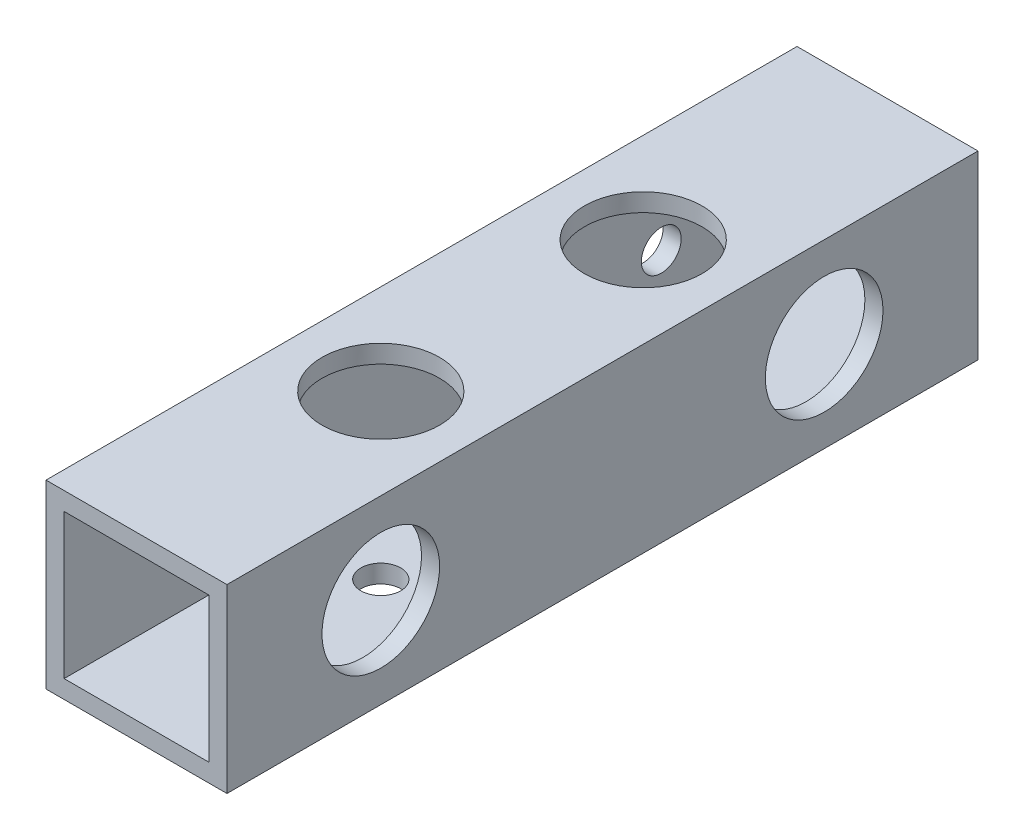
ISO-10303-21;
HEADER;
FILE_DESCRIPTION(('STEP AP214'),'2;1');
FILE_NAME('part.step','',(''),(''),'','','');
FILE_SCHEMA(('AUTOMOTIVE_DESIGN { 1 0 10303 214 1 1 1 1 }'));
ENDSEC;
DATA;
#1=APPLICATION_CONTEXT('core data for automotive mechanical design processes');
#2=APPLICATION_PROTOCOL_DEFINITION('international standard','automotive_design',2000,#1);
#3=PRODUCT_CONTEXT('',#1,'mechanical');
#4=PRODUCT('Part','Part','',(#3));
#5=PRODUCT_RELATED_PRODUCT_CATEGORY('part','',(#4));
#6=PRODUCT_DEFINITION_FORMATION('','',#4);
#7=PRODUCT_DEFINITION_CONTEXT('part definition',#1,'design');
#8=PRODUCT_DEFINITION('design','',#6,#7);
#9=PRODUCT_DEFINITION_SHAPE('','',#8);
#10=(LENGTH_UNIT() NAMED_UNIT(*) SI_UNIT(.MILLI.,.METRE.));
#11=(NAMED_UNIT(*) PLANE_ANGLE_UNIT() SI_UNIT($,.RADIAN.));
#12=(NAMED_UNIT(*) SI_UNIT($,.STERADIAN.) SOLID_ANGLE_UNIT());
#13=UNCERTAINTY_MEASURE_WITH_UNIT(LENGTH_MEASURE(1.E-05),#10,'distance_accuracy_value','');
#14=(GEOMETRIC_REPRESENTATION_CONTEXT(3) GLOBAL_UNCERTAINTY_ASSIGNED_CONTEXT((#13)) GLOBAL_UNIT_ASSIGNED_CONTEXT((#10,
#11,#12)) REPRESENTATION_CONTEXT('',''));
#15=CARTESIAN_POINT('',(0.,0.,0.));
#16=DIRECTION('',(0.,0.,1.));
#17=DIRECTION('',(1.,0.,0.));
#18=AXIS2_PLACEMENT_3D('',#15,#16,#17);
#19=CARTESIAN_POINT('',(0.,0.,83.));
#20=DIRECTION('',(0.,0.,1.));
#21=DIRECTION('',(1.,0.,0.));
#22=AXIS2_PLACEMENT_3D('',#19,#20,#21);
#23=PLANE('',#22);
#24=DIRECTION('',(0.,1.,0.));
#25=VECTOR('',#24,1.);
#26=CARTESIAN_POINT('',(10.,10.,83.));
#27=LINE('',#26,#25);
#28=CARTESIAN_POINT('',(10.,-10.,83.));
#29=VERTEX_POINT('',#28);
#30=CARTESIAN_POINT('',(10.,10.,83.));
#31=VERTEX_POINT('',#30);
#32=EDGE_CURVE('E156',#29,#31,#27,.T.);
#33=ORIENTED_EDGE('',*,*,#32,.T.);
#34=DIRECTION('',(-1.,0.,0.));
#35=VECTOR('',#34,1.);
#36=CARTESIAN_POINT('',(-10.,10.,83.));
#37=LINE('',#36,#35);
#38=CARTESIAN_POINT('',(-10.,10.,83.));
#39=VERTEX_POINT('',#38);
#40=EDGE_CURVE('E160',#31,#39,#37,.T.);
#41=ORIENTED_EDGE('',*,*,#40,.T.);
#42=DIRECTION('',(0.,-1.,0.));
#43=VECTOR('',#42,1.);
#44=CARTESIAN_POINT('',(-10.,10.,83.));
#45=LINE('',#44,#43);
#46=CARTESIAN_POINT('',(-10.,-10.,83.));
#47=VERTEX_POINT('',#46);
#48=EDGE_CURVE('E164',#39,#47,#45,.T.);
#49=ORIENTED_EDGE('',*,*,#48,.T.);
#50=DIRECTION('',(1.,0.,0.));
#51=VECTOR('',#50,1.);
#52=CARTESIAN_POINT('',(-10.,-10.,83.));
#53=LINE('',#52,#51);
#54=EDGE_CURVE('E167',#47,#29,#53,.T.);
#55=ORIENTED_EDGE('',*,*,#54,.T.);
#56=EDGE_LOOP('',(#33,#41,#49,#55));
#57=FACE_BOUND('',#56,.T.);
#58=DIRECTION('',(-1.,0.,0.));
#59=VECTOR('',#58,1.);
#60=CARTESIAN_POINT('',(-8.,8.,83.));
#61=LINE('',#60,#59);
#62=CARTESIAN_POINT('',(8.,8.,83.));
#63=VERTEX_POINT('',#62);
#64=CARTESIAN_POINT('',(-8.,8.,83.));
#65=VERTEX_POINT('',#64);
#66=EDGE_CURVE('E115',#63,#65,#61,.T.);
#67=ORIENTED_EDGE('',*,*,#66,.F.);
#68=DIRECTION('',(0.,1.,0.));
#69=VECTOR('',#68,1.);
#70=CARTESIAN_POINT('',(8.,8.,83.));
#71=LINE('',#70,#69);
#72=CARTESIAN_POINT('',(8.,-8.,83.));
#73=VERTEX_POINT('',#72);
#74=EDGE_CURVE('E106',#73,#63,#71,.T.);
#75=ORIENTED_EDGE('',*,*,#74,.F.);
#76=DIRECTION('',(1.,0.,0.));
#77=VECTOR('',#76,1.);
#78=CARTESIAN_POINT('',(-8.,-8.,83.));
#79=LINE('',#78,#77);
#80=CARTESIAN_POINT('',(-8.,-8.,83.));
#81=VERTEX_POINT('',#80);
#82=EDGE_CURVE('E132',#81,#73,#79,.T.);
#83=ORIENTED_EDGE('',*,*,#82,.F.);
#84=DIRECTION('',(0.,-1.,0.));
#85=VECTOR('',#84,1.);
#86=CARTESIAN_POINT('',(-8.,8.,83.));
#87=LINE('',#86,#85);
#88=EDGE_CURVE('E128',#65,#81,#87,.T.);
#89=ORIENTED_EDGE('',*,*,#88,.F.);
#90=EDGE_LOOP('',(#67,#75,#83,#89));
#91=FACE_BOUND('',#90,.T.);
#92=ADVANCED_FACE('F38',(#57,#91),#23,.T.);
#93=CARTESIAN_POINT('',(0.,0.,0.));
#94=DIRECTION('',(0.,0.,1.));
#95=DIRECTION('',(1.,0.,0.));
#96=AXIS2_PLACEMENT_3D('',#93,#94,#95);
#97=PLANE('',#96);
#98=DIRECTION('',(0.,1.,0.));
#99=VECTOR('',#98,1.);
#100=CARTESIAN_POINT('',(10.,10.,0.));
#101=LINE('',#100,#99);
#102=CARTESIAN_POINT('',(10.,-10.,0.));
#103=VERTEX_POINT('',#102);
#104=CARTESIAN_POINT('',(10.,10.,0.));
#105=VERTEX_POINT('',#104);
#106=EDGE_CURVE('E124',#103,#105,#101,.T.);
#107=ORIENTED_EDGE('',*,*,#106,.F.);
#108=DIRECTION('',(1.,0.,0.));
#109=VECTOR('',#108,1.);
#110=CARTESIAN_POINT('',(-10.,-10.,0.));
#111=LINE('',#110,#109);
#112=CARTESIAN_POINT('',(-10.,-10.,0.));
#113=VERTEX_POINT('',#112);
#114=EDGE_CURVE('E161',#113,#103,#111,.T.);
#115=ORIENTED_EDGE('',*,*,#114,.F.);
#116=DIRECTION('',(0.,-1.,0.));
#117=VECTOR('',#116,1.);
#118=CARTESIAN_POINT('',(-10.,10.,0.));
#119=LINE('',#118,#117);
#120=CARTESIAN_POINT('',(-10.,10.,0.));
#121=VERTEX_POINT('',#120);
#122=EDGE_CURVE('E177',#121,#113,#119,.T.);
#123=ORIENTED_EDGE('',*,*,#122,.F.);
#124=DIRECTION('',(-1.,0.,0.));
#125=VECTOR('',#124,1.);
#126=CARTESIAN_POINT('',(-10.,10.,0.));
#127=LINE('',#126,#125);
#128=EDGE_CURVE('E174',#105,#121,#127,.T.);
#129=ORIENTED_EDGE('',*,*,#128,.F.);
#130=EDGE_LOOP('',(#107,#115,#123,#129));
#131=FACE_BOUND('',#130,.T.);
#132=DIRECTION('',(0.,1.,0.));
#133=VECTOR('',#132,1.);
#134=CARTESIAN_POINT('',(8.,8.,0.));
#135=LINE('',#134,#133);
#136=CARTESIAN_POINT('',(8.,-8.,0.));
#137=VERTEX_POINT('',#136);
#138=CARTESIAN_POINT('',(8.,8.,0.));
#139=VERTEX_POINT('',#138);
#140=EDGE_CURVE('E64',#137,#139,#135,.T.);
#141=ORIENTED_EDGE('',*,*,#140,.T.);
#142=DIRECTION('',(-1.,0.,0.));
#143=VECTOR('',#142,1.);
#144=CARTESIAN_POINT('',(-8.,8.,0.));
#145=LINE('',#144,#143);
#146=CARTESIAN_POINT('',(-8.,8.,0.));
#147=VERTEX_POINT('',#146);
#148=EDGE_CURVE('E122',#139,#147,#145,.T.);
#149=ORIENTED_EDGE('',*,*,#148,.T.);
#150=DIRECTION('',(0.,-1.,0.));
#151=VECTOR('',#150,1.);
#152=CARTESIAN_POINT('',(-8.,8.,0.));
#153=LINE('',#152,#151);
#154=CARTESIAN_POINT('',(-8.,-8.,0.));
#155=VERTEX_POINT('',#154);
#156=EDGE_CURVE('E143',#147,#155,#153,.T.);
#157=ORIENTED_EDGE('',*,*,#156,.T.);
#158=DIRECTION('',(1.,0.,0.));
#159=VECTOR('',#158,1.);
#160=CARTESIAN_POINT('',(-8.,-8.,0.));
#161=LINE('',#160,#159);
#162=EDGE_CURVE('E116',#155,#137,#161,.T.);
#163=ORIENTED_EDGE('',*,*,#162,.T.);
#164=EDGE_LOOP('',(#141,#149,#157,#163));
#165=FACE_BOUND('',#164,.T.);
#166=ADVANCED_FACE('F276',(#131,#165),#97,.F.);
#167=CARTESIAN_POINT('',(10.,10.,83.));
#168=DIRECTION('',(-1.,0.,0.));
#169=DIRECTION('',(0.,0.,1.));
#170=AXIS2_PLACEMENT_3D('',#167,#168,#169);
#171=PLANE('',#170);
#172=CARTESIAN_POINT('',(10.,0.,66.));
#173=DIRECTION('',(1.,0.,0.));
#174=DIRECTION('',(0.,0.,-1.));
#175=AXIS2_PLACEMENT_3D('',#172,#173,#174);
#176=CIRCLE('',#175,6.5);
#177=CARTESIAN_POINT('',(10.,0.,59.5));
#178=VERTEX_POINT('',#177);
#179=EDGE_CURVE('E206',#178,#178,#176,.T.);
#180=ORIENTED_EDGE('',*,*,#179,.F.);
#181=EDGE_LOOP('',(#180));
#182=FACE_BOUND('',#181,.T.);
#183=CARTESIAN_POINT('',(10.,0.,17.));
#184=DIRECTION('',(1.,0.,0.));
#185=DIRECTION('',(0.,0.,-1.));
#186=AXIS2_PLACEMENT_3D('',#183,#184,#185);
#187=CIRCLE('',#186,6.5);
#188=CARTESIAN_POINT('',(10.,0.,10.5));
#189=VERTEX_POINT('',#188);
#190=EDGE_CURVE('E243',#189,#189,#187,.T.);
#191=ORIENTED_EDGE('',*,*,#190,.F.);
#192=EDGE_LOOP('',(#191));
#193=FACE_BOUND('',#192,.T.);
#194=ORIENTED_EDGE('',*,*,#106,.T.);
#195=DIRECTION('',(0.,0.,-1.));
#196=VECTOR('',#195,1.);
#197=CARTESIAN_POINT('',(10.,10.,83.));
#198=LINE('',#197,#196);
#199=EDGE_CURVE('E11',#31,#105,#198,.T.);
#200=ORIENTED_EDGE('',*,*,#199,.F.);
#201=ORIENTED_EDGE('',*,*,#32,.F.);
#202=DIRECTION('',(0.,0.,-1.));
#203=VECTOR('',#202,1.);
#204=CARTESIAN_POINT('',(10.,-10.,83.));
#205=LINE('',#204,#203);
#206=EDGE_CURVE('E170',#29,#103,#205,.T.);
#207=ORIENTED_EDGE('',*,*,#206,.T.);
#208=EDGE_LOOP('',(#194,#200,#201,#207));
#209=FACE_BOUND('',#208,.T.);
#210=ADVANCED_FACE('F40',(#182,#193,#209),#171,.F.);
#211=CARTESIAN_POINT('',(-10.,10.,83.));
#212=DIRECTION('',(0.,-1.,0.));
#213=DIRECTION('',(0.,0.,-1.));
#214=AXIS2_PLACEMENT_3D('',#211,#212,#213);
#215=PLANE('',#214);
#216=CARTESIAN_POINT('',(0.,10.,56.));
#217=DIRECTION('',(0.,1.,0.));
#218=DIRECTION('',(0.,0.,1.));
#219=AXIS2_PLACEMENT_3D('',#216,#217,#218);
#220=CIRCLE('',#219,6.5);
#221=CARTESIAN_POINT('',(0.,10.,62.5));
#222=VERTEX_POINT('',#221);
#223=EDGE_CURVE('E222',#222,#222,#220,.T.);
#224=ORIENTED_EDGE('',*,*,#223,.F.);
#225=EDGE_LOOP('',(#224));
#226=FACE_BOUND('',#225,.T.);
#227=CARTESIAN_POINT('',(0.,10.,27.));
#228=DIRECTION('',(0.,1.,0.));
#229=DIRECTION('',(0.,0.,1.));
#230=AXIS2_PLACEMENT_3D('',#227,#228,#229);
#231=CIRCLE('',#230,6.5);
#232=CARTESIAN_POINT('',(0.,10.,33.5));
#233=VERTEX_POINT('',#232);
#234=EDGE_CURVE('E229',#233,#233,#231,.T.);
#235=ORIENTED_EDGE('',*,*,#234,.F.);
#236=EDGE_LOOP('',(#235));
#237=FACE_BOUND('',#236,.T.);
#238=ORIENTED_EDGE('',*,*,#128,.T.);
#239=DIRECTION('',(0.,0.,-1.));
#240=VECTOR('',#239,1.);
#241=CARTESIAN_POINT('',(-10.,10.,83.));
#242=LINE('',#241,#240);
#243=EDGE_CURVE('E48',#39,#121,#242,.T.);
#244=ORIENTED_EDGE('',*,*,#243,.F.);
#245=ORIENTED_EDGE('',*,*,#40,.F.);
#246=ORIENTED_EDGE('',*,*,#199,.T.);
#247=EDGE_LOOP('',(#238,#244,#245,#246));
#248=FACE_BOUND('',#247,.T.);
#249=ADVANCED_FACE('F292',(#226,#237,#248),#215,.F.);
#250=CARTESIAN_POINT('',(-10.,10.,83.));
#251=DIRECTION('',(1.,0.,0.));
#252=DIRECTION('',(0.,0.,-1.));
#253=AXIS2_PLACEMENT_3D('',#250,#251,#252);
#254=PLANE('',#253);
#255=CARTESIAN_POINT('',(-10.,0.,66.));
#256=DIRECTION('',(1.,0.,0.));
#257=DIRECTION('',(0.,0.,-1.));
#258=AXIS2_PLACEMENT_3D('',#255,#256,#257);
#259=CIRCLE('',#258,2.2);
#260=CARTESIAN_POINT('',(-10.,0.,63.8));
#261=VERTEX_POINT('',#260);
#262=EDGE_CURVE('E140',#261,#261,#259,.T.);
#263=ORIENTED_EDGE('',*,*,#262,.T.);
#264=EDGE_LOOP('',(#263));
#265=FACE_BOUND('',#264,.T.);
#266=CARTESIAN_POINT('',(-10.,0.,17.));
#267=DIRECTION('',(1.,0.,0.));
#268=DIRECTION('',(0.,0.,-1.));
#269=AXIS2_PLACEMENT_3D('',#266,#267,#268);
#270=CIRCLE('',#269,2.2);
#271=CARTESIAN_POINT('',(-10.,0.,14.8));
#272=VERTEX_POINT('',#271);
#273=EDGE_CURVE('E196',#272,#272,#270,.T.);
#274=ORIENTED_EDGE('',*,*,#273,.T.);
#275=EDGE_LOOP('',(#274));
#276=FACE_BOUND('',#275,.T.);
#277=ORIENTED_EDGE('',*,*,#122,.T.);
#278=DIRECTION('',(0.,0.,-1.));
#279=VECTOR('',#278,1.);
#280=CARTESIAN_POINT('',(-10.,-10.,83.));
#281=LINE('',#280,#279);
#282=EDGE_CURVE('E185',#47,#113,#281,.T.);
#283=ORIENTED_EDGE('',*,*,#282,.F.);
#284=ORIENTED_EDGE('',*,*,#48,.F.);
#285=ORIENTED_EDGE('',*,*,#243,.T.);
#286=EDGE_LOOP('',(#277,#283,#284,#285));
#287=FACE_BOUND('',#286,.T.);
#288=ADVANCED_FACE('F256',(#265,#276,#287),#254,.F.);
#289=CARTESIAN_POINT('',(-10.,-10.,83.));
#290=DIRECTION('',(0.,1.,0.));
#291=DIRECTION('',(0.,0.,1.));
#292=AXIS2_PLACEMENT_3D('',#289,#290,#291);
#293=PLANE('',#292);
#294=CARTESIAN_POINT('',(0.,-10.,56.));
#295=DIRECTION('',(0.,1.,0.));
#296=DIRECTION('',(0.,0.,1.));
#297=AXIS2_PLACEMENT_3D('',#294,#295,#296);
#298=CIRCLE('',#297,2.2);
#299=CARTESIAN_POINT('',(0.,-10.,58.2));
#300=VERTEX_POINT('',#299);
#301=EDGE_CURVE('E218',#300,#300,#298,.T.);
#302=ORIENTED_EDGE('',*,*,#301,.T.);
#303=EDGE_LOOP('',(#302));
#304=FACE_BOUND('',#303,.T.);
#305=CARTESIAN_POINT('',(0.,-10.,27.));
#306=DIRECTION('',(0.,1.,0.));
#307=DIRECTION('',(0.,0.,1.));
#308=AXIS2_PLACEMENT_3D('',#305,#306,#307);
#309=CIRCLE('',#308,2.2);
#310=CARTESIAN_POINT('',(0.,-10.,29.2));
#311=VERTEX_POINT('',#310);
#312=EDGE_CURVE('E214',#311,#311,#309,.T.);
#313=ORIENTED_EDGE('',*,*,#312,.T.);
#314=EDGE_LOOP('',(#313));
#315=FACE_BOUND('',#314,.T.);
#316=ORIENTED_EDGE('',*,*,#114,.T.);
#317=ORIENTED_EDGE('',*,*,#206,.F.);
#318=ORIENTED_EDGE('',*,*,#54,.F.);
#319=ORIENTED_EDGE('',*,*,#282,.T.);
#320=EDGE_LOOP('',(#316,#317,#318,#319));
#321=FACE_BOUND('',#320,.T.);
#322=ADVANCED_FACE('F287',(#304,#315,#321),#293,.F.);
#323=CARTESIAN_POINT('',(8.,8.,83.));
#324=DIRECTION('',(-1.,0.,0.));
#325=DIRECTION('',(0.,0.,1.));
#326=AXIS2_PLACEMENT_3D('',#323,#324,#325);
#327=PLANE('',#326);
#328=CARTESIAN_POINT('',(8.,0.,66.));
#329=DIRECTION('',(-1.,0.,0.));
#330=DIRECTION('',(0.,0.,1.));
#331=AXIS2_PLACEMENT_3D('',#328,#329,#330);
#332=CIRCLE('',#331,6.5);
#333=CARTESIAN_POINT('',(8.,0.,72.5));
#334=VERTEX_POINT('',#333);
#335=EDGE_CURVE('E197',#334,#334,#332,.T.);
#336=ORIENTED_EDGE('',*,*,#335,.F.);
#337=EDGE_LOOP('',(#336));
#338=FACE_BOUND('',#337,.T.);
#339=CARTESIAN_POINT('',(8.,0.,17.));
#340=DIRECTION('',(-1.,0.,0.));
#341=DIRECTION('',(0.,0.,1.));
#342=AXIS2_PLACEMENT_3D('',#339,#340,#341);
#343=CIRCLE('',#342,6.5);
#344=CARTESIAN_POINT('',(8.,0.,23.5));
#345=VERTEX_POINT('',#344);
#346=EDGE_CURVE('E202',#345,#345,#343,.T.);
#347=ORIENTED_EDGE('',*,*,#346,.F.);
#348=EDGE_LOOP('',(#347));
#349=FACE_BOUND('',#348,.T.);
#350=ORIENTED_EDGE('',*,*,#140,.F.);
#351=DIRECTION('',(0.,0.,-1.));
#352=VECTOR('',#351,1.);
#353=CARTESIAN_POINT('',(8.,-8.,83.));
#354=LINE('',#353,#352);
#355=EDGE_CURVE('E110',#73,#137,#354,.T.);
#356=ORIENTED_EDGE('',*,*,#355,.F.);
#357=ORIENTED_EDGE('',*,*,#74,.T.);
#358=DIRECTION('',(0.,0.,-1.));
#359=VECTOR('',#358,1.);
#360=CARTESIAN_POINT('',(8.,8.,83.));
#361=LINE('',#360,#359);
#362=EDGE_CURVE('E109',#63,#139,#361,.T.);
#363=ORIENTED_EDGE('',*,*,#362,.T.);
#364=EDGE_LOOP('',(#350,#356,#357,#363));
#365=FACE_BOUND('',#364,.T.);
#366=ADVANCED_FACE('F108',(#338,#349,#365),#327,.T.);
#367=CARTESIAN_POINT('',(-8.,8.,83.));
#368=DIRECTION('',(0.,-1.,0.));
#369=DIRECTION('',(0.,0.,-1.));
#370=AXIS2_PLACEMENT_3D('',#367,#368,#369);
#371=PLANE('',#370);
#372=CARTESIAN_POINT('',(0.,8.,56.));
#373=DIRECTION('',(0.,-1.,0.));
#374=DIRECTION('',(0.,0.,-1.));
#375=AXIS2_PLACEMENT_3D('',#372,#373,#374);
#376=CIRCLE('',#375,6.5);
#377=CARTESIAN_POINT('',(0.,8.,49.5));
#378=VERTEX_POINT('',#377);
#379=EDGE_CURVE('E42',#378,#378,#376,.T.);
#380=ORIENTED_EDGE('',*,*,#379,.F.);
#381=EDGE_LOOP('',(#380));
#382=FACE_BOUND('',#381,.T.);
#383=CARTESIAN_POINT('',(0.,8.,27.));
#384=DIRECTION('',(0.,-1.,0.));
#385=DIRECTION('',(0.,0.,-1.));
#386=AXIS2_PLACEMENT_3D('',#383,#384,#385);
#387=CIRCLE('',#386,6.5);
#388=CARTESIAN_POINT('',(0.,8.,20.5));
#389=VERTEX_POINT('',#388);
#390=EDGE_CURVE('E219',#389,#389,#387,.T.);
#391=ORIENTED_EDGE('',*,*,#390,.F.);
#392=EDGE_LOOP('',(#391));
#393=FACE_BOUND('',#392,.T.);
#394=ORIENTED_EDGE('',*,*,#148,.F.);
#395=ORIENTED_EDGE('',*,*,#362,.F.);
#396=ORIENTED_EDGE('',*,*,#66,.T.);
#397=DIRECTION('',(0.,0.,-1.));
#398=VECTOR('',#397,1.);
#399=CARTESIAN_POINT('',(-8.,8.,83.));
#400=LINE('',#399,#398);
#401=EDGE_CURVE('E125',#65,#147,#400,.T.);
#402=ORIENTED_EDGE('',*,*,#401,.T.);
#403=EDGE_LOOP('',(#394,#395,#396,#402));
#404=FACE_BOUND('',#403,.T.);
#405=ADVANCED_FACE('F119',(#382,#393,#404),#371,.T.);
#406=CARTESIAN_POINT('',(-8.,8.,83.));
#407=DIRECTION('',(1.,0.,0.));
#408=DIRECTION('',(0.,0.,-1.));
#409=AXIS2_PLACEMENT_3D('',#406,#407,#408);
#410=PLANE('',#409);
#411=CARTESIAN_POINT('',(-8.00000000000001,0.,66.));
#412=DIRECTION('',(1.,0.,0.));
#413=DIRECTION('',(0.,0.,-1.));
#414=AXIS2_PLACEMENT_3D('',#411,#412,#413);
#415=CIRCLE('',#414,2.2);
#416=CARTESIAN_POINT('',(-8.00000000000001,0.,63.8));
#417=VERTEX_POINT('',#416);
#418=EDGE_CURVE('E198',#417,#417,#415,.T.);
#419=ORIENTED_EDGE('',*,*,#418,.F.);
#420=EDGE_LOOP('',(#419));
#421=FACE_BOUND('',#420,.T.);
#422=CARTESIAN_POINT('',(-8.00000000000001,0.,17.));
#423=DIRECTION('',(1.,0.,0.));
#424=DIRECTION('',(0.,0.,-1.));
#425=AXIS2_PLACEMENT_3D('',#422,#423,#424);
#426=CIRCLE('',#425,2.2);
#427=CARTESIAN_POINT('',(-8.00000000000001,0.,14.8));
#428=VERTEX_POINT('',#427);
#429=EDGE_CURVE('E192',#428,#428,#426,.T.);
#430=ORIENTED_EDGE('',*,*,#429,.F.);
#431=EDGE_LOOP('',(#430));
#432=FACE_BOUND('',#431,.T.);
#433=ORIENTED_EDGE('',*,*,#156,.F.);
#434=ORIENTED_EDGE('',*,*,#401,.F.);
#435=ORIENTED_EDGE('',*,*,#88,.T.);
#436=DIRECTION('',(0.,0.,-1.));
#437=VECTOR('',#436,1.);
#438=CARTESIAN_POINT('',(-8.,-8.,83.));
#439=LINE('',#438,#437);
#440=EDGE_CURVE('E56',#81,#155,#439,.T.);
#441=ORIENTED_EDGE('',*,*,#440,.T.);
#442=EDGE_LOOP('',(#433,#434,#435,#441));
#443=FACE_BOUND('',#442,.T.);
#444=ADVANCED_FACE('F320',(#421,#432,#443),#410,.T.);
#445=CARTESIAN_POINT('',(-8.,-8.,83.));
#446=DIRECTION('',(0.,1.,0.));
#447=DIRECTION('',(0.,0.,1.));
#448=AXIS2_PLACEMENT_3D('',#445,#446,#447);
#449=PLANE('',#448);
#450=CARTESIAN_POINT('',(0.,-8.,56.));
#451=DIRECTION('',(0.,1.,0.));
#452=DIRECTION('',(0.,0.,1.));
#453=AXIS2_PLACEMENT_3D('',#450,#451,#452);
#454=CIRCLE('',#453,2.2);
#455=CARTESIAN_POINT('',(0.,-8.,58.2));
#456=VERTEX_POINT('',#455);
#457=EDGE_CURVE('E215',#456,#456,#454,.T.);
#458=ORIENTED_EDGE('',*,*,#457,.F.);
#459=EDGE_LOOP('',(#458));
#460=FACE_BOUND('',#459,.T.);
#461=CARTESIAN_POINT('',(0.,-8.,27.));
#462=DIRECTION('',(0.,1.,0.));
#463=DIRECTION('',(0.,0.,1.));
#464=AXIS2_PLACEMENT_3D('',#461,#462,#463);
#465=CIRCLE('',#464,2.2);
#466=CARTESIAN_POINT('',(0.,-8.,29.2));
#467=VERTEX_POINT('',#466);
#468=EDGE_CURVE('E210',#467,#467,#465,.T.);
#469=ORIENTED_EDGE('',*,*,#468,.F.);
#470=EDGE_LOOP('',(#469));
#471=FACE_BOUND('',#470,.T.);
#472=ORIENTED_EDGE('',*,*,#162,.F.);
#473=ORIENTED_EDGE('',*,*,#440,.F.);
#474=ORIENTED_EDGE('',*,*,#82,.T.);
#475=ORIENTED_EDGE('',*,*,#355,.T.);
#476=EDGE_LOOP('',(#472,#473,#474,#475));
#477=FACE_BOUND('',#476,.T.);
#478=ADVANCED_FACE('F272',(#460,#471,#477),#449,.T.);
#479=CARTESIAN_POINT('',(-73.,0.,17.));
#480=DIRECTION('',(1.,0.,0.));
#481=DIRECTION('',(0.,0.,-1.));
#482=AXIS2_PLACEMENT_3D('',#479,#480,#481);
#483=CYLINDRICAL_SURFACE('',#482,2.2);
#484=ORIENTED_EDGE('',*,*,#429,.T.);
#485=EDGE_LOOP('',(#484));
#486=FACE_BOUND('',#485,.T.);
#487=ORIENTED_EDGE('',*,*,#273,.F.);
#488=EDGE_LOOP('',(#487));
#489=FACE_BOUND('',#488,.T.);
#490=ADVANCED_FACE('F262',(#486,#489),#483,.F.);
#491=CARTESIAN_POINT('',(-73.,0.,66.));
#492=DIRECTION('',(1.,0.,0.));
#493=DIRECTION('',(0.,0.,-1.));
#494=AXIS2_PLACEMENT_3D('',#491,#492,#493);
#495=CYLINDRICAL_SURFACE('',#494,2.2);
#496=ORIENTED_EDGE('',*,*,#418,.T.);
#497=EDGE_LOOP('',(#496));
#498=FACE_BOUND('',#497,.T.);
#499=ORIENTED_EDGE('',*,*,#262,.F.);
#500=EDGE_LOOP('',(#499));
#501=FACE_BOUND('',#500,.T.);
#502=ADVANCED_FACE('F259',(#498,#501),#495,.F.);
#503=CARTESIAN_POINT('',(7.,0.,17.));
#504=DIRECTION('',(1.,0.,0.));
#505=DIRECTION('',(0.,0.,-1.));
#506=AXIS2_PLACEMENT_3D('',#503,#504,#505);
#507=CYLINDRICAL_SURFACE('',#506,6.5);
#508=ORIENTED_EDGE('',*,*,#346,.T.);
#509=EDGE_LOOP('',(#508));
#510=FACE_BOUND('',#509,.T.);
#511=ORIENTED_EDGE('',*,*,#190,.T.);
#512=EDGE_LOOP('',(#511));
#513=FACE_BOUND('',#512,.T.);
#514=ADVANCED_FACE('F261',(#510,#513),#507,.F.);
#515=CARTESIAN_POINT('',(7.,0.,66.));
#516=DIRECTION('',(1.,0.,0.));
#517=DIRECTION('',(0.,0.,-1.));
#518=AXIS2_PLACEMENT_3D('',#515,#516,#517);
#519=CYLINDRICAL_SURFACE('',#518,6.5);
#520=ORIENTED_EDGE('',*,*,#335,.T.);
#521=EDGE_LOOP('',(#520));
#522=FACE_BOUND('',#521,.T.);
#523=ORIENTED_EDGE('',*,*,#179,.T.);
#524=EDGE_LOOP('',(#523));
#525=FACE_BOUND('',#524,.T.);
#526=ADVANCED_FACE('F269',(#522,#525),#519,.F.);
#527=CARTESIAN_POINT('',(0.,10.,27.));
#528=DIRECTION('',(0.,-1.,0.));
#529=DIRECTION('',(0.,0.,-1.));
#530=AXIS2_PLACEMENT_3D('',#527,#528,#529);
#531=CYLINDRICAL_SURFACE('',#530,2.2);
#532=ORIENTED_EDGE('',*,*,#468,.T.);
#533=EDGE_LOOP('',(#532));
#534=FACE_BOUND('',#533,.T.);
#535=ORIENTED_EDGE('',*,*,#312,.F.);
#536=EDGE_LOOP('',(#535));
#537=FACE_BOUND('',#536,.T.);
#538=ADVANCED_FACE('F351',(#534,#537),#531,.F.);
#539=CARTESIAN_POINT('',(0.,10.,56.));
#540=DIRECTION('',(0.,-1.,0.));
#541=DIRECTION('',(0.,0.,-1.));
#542=AXIS2_PLACEMENT_3D('',#539,#540,#541);
#543=CYLINDRICAL_SURFACE('',#542,2.2);
#544=ORIENTED_EDGE('',*,*,#457,.T.);
#545=EDGE_LOOP('',(#544));
#546=FACE_BOUND('',#545,.T.);
#547=ORIENTED_EDGE('',*,*,#301,.F.);
#548=EDGE_LOOP('',(#547));
#549=FACE_BOUND('',#548,.T.);
#550=ADVANCED_FACE('F346',(#546,#549),#543,.F.);
#551=CARTESIAN_POINT('',(0.,7.,27.));
#552=DIRECTION('',(0.,1.,0.));
#553=DIRECTION('',(0.,0.,1.));
#554=AXIS2_PLACEMENT_3D('',#551,#552,#553);
#555=CYLINDRICAL_SURFACE('',#554,6.5);
#556=ORIENTED_EDGE('',*,*,#390,.T.);
#557=EDGE_LOOP('',(#556));
#558=FACE_BOUND('',#557,.T.);
#559=ORIENTED_EDGE('',*,*,#234,.T.);
#560=EDGE_LOOP('',(#559));
#561=FACE_BOUND('',#560,.T.);
#562=ADVANCED_FACE('F341',(#558,#561),#555,.F.);
#563=CARTESIAN_POINT('',(0.,7.,56.));
#564=DIRECTION('',(0.,1.,0.));
#565=DIRECTION('',(0.,0.,1.));
#566=AXIS2_PLACEMENT_3D('',#563,#564,#565);
#567=CYLINDRICAL_SURFACE('',#566,6.5);
#568=ORIENTED_EDGE('',*,*,#379,.T.);
#569=EDGE_LOOP('',(#568));
#570=FACE_BOUND('',#569,.T.);
#571=ORIENTED_EDGE('',*,*,#223,.T.);
#572=EDGE_LOOP('',(#571));
#573=FACE_BOUND('',#572,.T.);
#574=ADVANCED_FACE('F339',(#570,#573),#567,.F.);
#575=CLOSED_SHELL('',(#92,#166,#210,#249,#288,#322,#366,#405,#444,#478,#490,#502,#514,#526,#538,
#550,#562,#574));
#576=MANIFOLD_SOLID_BREP('B2',#575);
#577=ADVANCED_BREP_SHAPE_REPRESENTATION('',(#18,#576),#14);
#578=SHAPE_DEFINITION_REPRESENTATION(#9,#577);
ENDSEC;
END-ISO-10303-21;
